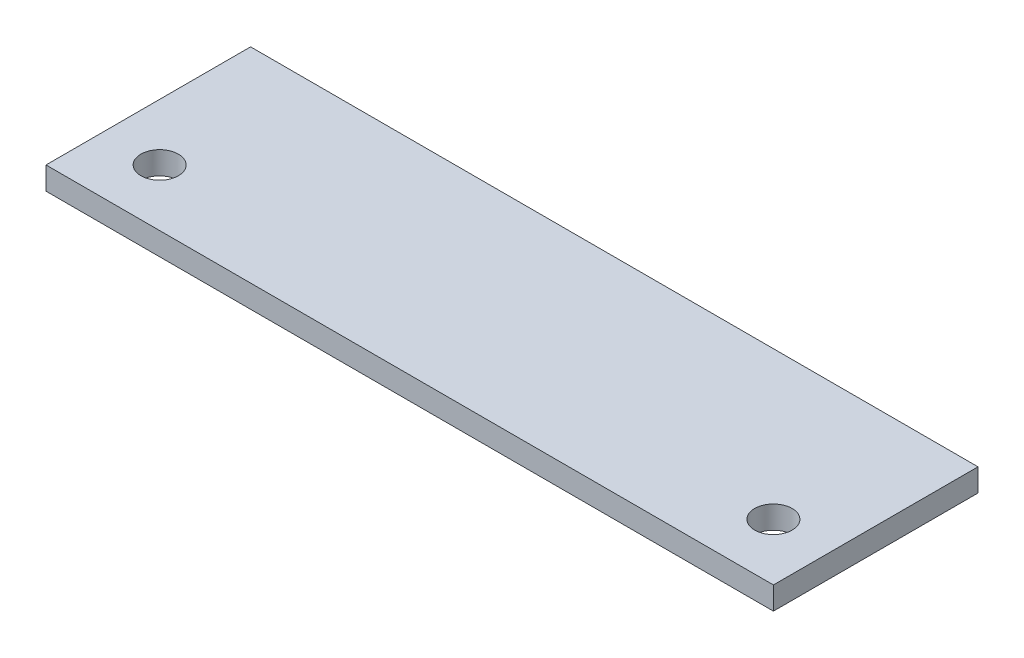
ISO-10303-21;
HEADER;
FILE_DESCRIPTION(('STEP AP214'),'2;1');
FILE_NAME('part.step','',(''),(''),'','','');
FILE_SCHEMA(('AUTOMOTIVE_DESIGN { 1 0 10303 214 1 1 1 1 }'));
ENDSEC;
DATA;
#1=APPLICATION_CONTEXT('core data for automotive mechanical design processes');
#2=APPLICATION_PROTOCOL_DEFINITION('international standard','automotive_design',2000,#1);
#3=PRODUCT_CONTEXT('',#1,'mechanical');
#4=PRODUCT('Part','Part','',(#3));
#5=PRODUCT_RELATED_PRODUCT_CATEGORY('part','',(#4));
#6=PRODUCT_DEFINITION_FORMATION('','',#4);
#7=PRODUCT_DEFINITION_CONTEXT('part definition',#1,'design');
#8=PRODUCT_DEFINITION('design','',#6,#7);
#9=PRODUCT_DEFINITION_SHAPE('','',#8);
#10=(LENGTH_UNIT() NAMED_UNIT(*) SI_UNIT(.MILLI.,.METRE.));
#11=(NAMED_UNIT(*) PLANE_ANGLE_UNIT() SI_UNIT($,.RADIAN.));
#12=(NAMED_UNIT(*) SI_UNIT($,.STERADIAN.) SOLID_ANGLE_UNIT());
#13=UNCERTAINTY_MEASURE_WITH_UNIT(LENGTH_MEASURE(1.E-05),#10,'distance_accuracy_value','');
#14=(GEOMETRIC_REPRESENTATION_CONTEXT(3) GLOBAL_UNCERTAINTY_ASSIGNED_CONTEXT((#13)) GLOBAL_UNIT_ASSIGNED_CONTEXT((#10,
#11,#12)) REPRESENTATION_CONTEXT('',''));
#15=CARTESIAN_POINT('',(0.,0.,0.));
#16=DIRECTION('',(0.,0.,1.));
#17=DIRECTION('',(1.,0.,0.));
#18=AXIS2_PLACEMENT_3D('',#15,#16,#17);
#19=CARTESIAN_POINT('',(0.,12.7,0.));
#20=DIRECTION('',(1.,0.,0.));
#21=DIRECTION('',(0.,0.,-1.));
#22=AXIS2_PLACEMENT_3D('',#19,#20,#21);
#23=PLANE('',#22);
#24=DIRECTION('',(0.,0.,1.));
#25=VECTOR('',#24,1.);
#26=CARTESIAN_POINT('',(0.,0.,0.));
#27=LINE('',#26,#25);
#28=CARTESIAN_POINT('',(0.,0.,-114.3));
#29=VERTEX_POINT('',#28);
#30=CARTESIAN_POINT('',(0.,0.,0.));
#31=VERTEX_POINT('',#30);
#32=EDGE_CURVE('E96',#29,#31,#27,.T.);
#33=ORIENTED_EDGE('',*,*,#32,.T.);
#34=DIRECTION('',(0.,-1.,0.));
#35=VECTOR('',#34,1.);
#36=CARTESIAN_POINT('',(0.,12.7,0.));
#37=LINE('',#36,#35);
#38=CARTESIAN_POINT('',(0.,12.7,0.));
#39=VERTEX_POINT('',#38);
#40=EDGE_CURVE('E11',#39,#31,#37,.T.);
#41=ORIENTED_EDGE('',*,*,#40,.F.);
#42=DIRECTION('',(0.,0.,1.));
#43=VECTOR('',#42,1.);
#44=CARTESIAN_POINT('',(0.,12.7,0.));
#45=LINE('',#44,#43);
#46=CARTESIAN_POINT('',(0.,12.7,-114.3));
#47=VERTEX_POINT('',#46);
#48=EDGE_CURVE('E84',#47,#39,#45,.T.);
#49=ORIENTED_EDGE('',*,*,#48,.F.);
#50=DIRECTION('',(0.,-1.,0.));
#51=VECTOR('',#50,1.);
#52=CARTESIAN_POINT('',(0.,12.7,-114.3));
#53=LINE('',#52,#51);
#54=EDGE_CURVE('E92',#47,#29,#53,.T.);
#55=ORIENTED_EDGE('',*,*,#54,.T.);
#56=EDGE_LOOP('',(#33,#41,#49,#55));
#57=FACE_BOUND('',#56,.T.);
#58=ADVANCED_FACE('F33',(#57),#23,.F.);
#59=CARTESIAN_POINT('',(0.,12.7,0.));
#60=DIRECTION('',(0.,0.,-1.));
#61=DIRECTION('',(-1.,0.,0.));
#62=AXIS2_PLACEMENT_3D('',#59,#60,#61);
#63=PLANE('',#62);
#64=DIRECTION('',(1.,0.,0.));
#65=VECTOR('',#64,1.);
#66=CARTESIAN_POINT('',(0.,0.,0.));
#67=LINE('',#66,#65);
#68=CARTESIAN_POINT('',(406.4,0.,0.));
#69=VERTEX_POINT('',#68);
#70=EDGE_CURVE('E88',#31,#69,#67,.T.);
#71=ORIENTED_EDGE('',*,*,#70,.T.);
#72=DIRECTION('',(0.,-1.,0.));
#73=VECTOR('',#72,1.);
#74=CARTESIAN_POINT('',(406.4,12.7,0.));
#75=LINE('',#74,#73);
#76=CARTESIAN_POINT('',(406.4,12.7,0.));
#77=VERTEX_POINT('',#76);
#78=EDGE_CURVE('E41',#77,#69,#75,.T.);
#79=ORIENTED_EDGE('',*,*,#78,.F.);
#80=DIRECTION('',(1.,0.,0.));
#81=VECTOR('',#80,1.);
#82=CARTESIAN_POINT('',(0.,12.7,0.));
#83=LINE('',#82,#81);
#84=EDGE_CURVE('E79',#39,#77,#83,.T.);
#85=ORIENTED_EDGE('',*,*,#84,.F.);
#86=ORIENTED_EDGE('',*,*,#40,.T.);
#87=EDGE_LOOP('',(#71,#79,#85,#86));
#88=FACE_BOUND('',#87,.T.);
#89=ADVANCED_FACE('F87',(#88),#63,.F.);
#90=CARTESIAN_POINT('',(406.4,12.7,0.));
#91=DIRECTION('',(-1.,0.,0.));
#92=DIRECTION('',(0.,0.,1.));
#93=AXIS2_PLACEMENT_3D('',#90,#91,#92);
#94=PLANE('',#93);
#95=DIRECTION('',(0.,0.,-1.));
#96=VECTOR('',#95,1.);
#97=CARTESIAN_POINT('',(406.4,0.,0.));
#98=LINE('',#97,#96);
#99=CARTESIAN_POINT('',(406.4,0.,-114.3));
#100=VERTEX_POINT('',#99);
#101=EDGE_CURVE('E66',#69,#100,#98,.T.);
#102=ORIENTED_EDGE('',*,*,#101,.T.);
#103=DIRECTION('',(0.,-1.,0.));
#104=VECTOR('',#103,1.);
#105=CARTESIAN_POINT('',(406.4,12.7,-114.3));
#106=LINE('',#105,#104);
#107=CARTESIAN_POINT('',(406.4,12.7,-114.3));
#108=VERTEX_POINT('',#107);
#109=EDGE_CURVE('E89',#108,#100,#106,.T.);
#110=ORIENTED_EDGE('',*,*,#109,.F.);
#111=DIRECTION('',(0.,0.,-1.));
#112=VECTOR('',#111,1.);
#113=CARTESIAN_POINT('',(406.4,12.7,0.));
#114=LINE('',#113,#112);
#115=EDGE_CURVE('E82',#77,#108,#114,.T.);
#116=ORIENTED_EDGE('',*,*,#115,.F.);
#117=ORIENTED_EDGE('',*,*,#78,.T.);
#118=EDGE_LOOP('',(#102,#110,#116,#117));
#119=FACE_BOUND('',#118,.T.);
#120=ADVANCED_FACE('F90',(#119),#94,.F.);
#121=CARTESIAN_POINT('',(0.,12.7,-114.3));
#122=DIRECTION('',(0.,0.,1.));
#123=DIRECTION('',(1.,0.,0.));
#124=AXIS2_PLACEMENT_3D('',#121,#122,#123);
#125=PLANE('',#124);
#126=DIRECTION('',(-1.,0.,0.));
#127=VECTOR('',#126,1.);
#128=CARTESIAN_POINT('',(0.,0.,-114.3));
#129=LINE('',#128,#127);
#130=EDGE_CURVE('E72',#100,#29,#129,.T.);
#131=ORIENTED_EDGE('',*,*,#130,.T.);
#132=ORIENTED_EDGE('',*,*,#54,.F.);
#133=DIRECTION('',(-1.,0.,0.));
#134=VECTOR('',#133,1.);
#135=CARTESIAN_POINT('',(0.,12.7,-114.3));
#136=LINE('',#135,#134);
#137=EDGE_CURVE('E49',#108,#47,#136,.T.);
#138=ORIENTED_EDGE('',*,*,#137,.F.);
#139=ORIENTED_EDGE('',*,*,#109,.T.);
#140=EDGE_LOOP('',(#131,#132,#138,#139));
#141=FACE_BOUND('',#140,.T.);
#142=ADVANCED_FACE('F104',(#141),#125,.F.);
#143=CARTESIAN_POINT('',(0.,12.7,-114.3));
#144=DIRECTION('',(0.,-1.,0.));
#145=DIRECTION('',(0.,0.,-1.));
#146=AXIS2_PLACEMENT_3D('',#143,#144,#145);
#147=PLANE('',#146);
#148=CARTESIAN_POINT('',(374.65,12.7,-31.75));
#149=DIRECTION('',(0.,1.,0.));
#150=DIRECTION('',(0.,0.,-1.));
#151=AXIS2_PLACEMENT_3D('',#148,#149,#150);
#152=CIRCLE('',#151,10.4775);
#153=CARTESIAN_POINT('',(374.65,12.7,-42.2275));
#154=VERTEX_POINT('',#153);
#155=EDGE_CURVE('E113',#154,#154,#152,.T.);
#156=ORIENTED_EDGE('',*,*,#155,.F.);
#157=EDGE_LOOP('',(#156));
#158=FACE_BOUND('',#157,.T.);
#159=CARTESIAN_POINT('',(31.75,12.7,-31.75));
#160=DIRECTION('',(0.,1.,0.));
#161=DIRECTION('',(0.,0.,1.));
#162=AXIS2_PLACEMENT_3D('',#159,#160,#161);
#163=CIRCLE('',#162,10.4775);
#164=CARTESIAN_POINT('',(31.75,12.7,-21.2725));
#165=VERTEX_POINT('',#164);
#166=EDGE_CURVE('E99',#165,#165,#163,.T.);
#167=ORIENTED_EDGE('',*,*,#166,.F.);
#168=EDGE_LOOP('',(#167));
#169=FACE_BOUND('',#168,.T.);
#170=ORIENTED_EDGE('',*,*,#48,.T.);
#171=ORIENTED_EDGE('',*,*,#84,.T.);
#172=ORIENTED_EDGE('',*,*,#115,.T.);
#173=ORIENTED_EDGE('',*,*,#137,.T.);
#174=EDGE_LOOP('',(#170,#171,#172,#173));
#175=FACE_BOUND('',#174,.T.);
#176=ADVANCED_FACE('F80',(#158,#169,#175),#147,.F.);
#177=CARTESIAN_POINT('',(0.,0.,-114.3));
#178=DIRECTION('',(0.,-1.,0.));
#179=DIRECTION('',(0.,0.,-1.));
#180=AXIS2_PLACEMENT_3D('',#177,#178,#179);
#181=PLANE('',#180);
#182=CARTESIAN_POINT('',(374.65,0.,-31.75));
#183=DIRECTION('',(0.,-1.,0.));
#184=DIRECTION('',(0.,0.,-1.));
#185=AXIS2_PLACEMENT_3D('',#182,#183,#184);
#186=CIRCLE('',#185,10.4775);
#187=CARTESIAN_POINT('',(374.65,0.,-42.2275));
#188=VERTEX_POINT('',#187);
#189=EDGE_CURVE('E116',#188,#188,#186,.F.);
#190=ORIENTED_EDGE('',*,*,#189,.T.);
#191=EDGE_LOOP('',(#190));
#192=FACE_BOUND('',#191,.T.);
#193=CARTESIAN_POINT('',(31.75,0.,-31.75));
#194=DIRECTION('',(0.,-1.,0.));
#195=DIRECTION('',(0.,0.,-1.));
#196=AXIS2_PLACEMENT_3D('',#193,#194,#195);
#197=CIRCLE('',#196,10.4775);
#198=CARTESIAN_POINT('',(31.75,0.,-42.2275));
#199=VERTEX_POINT('',#198);
#200=EDGE_CURVE('E110',#199,#199,#197,.F.);
#201=ORIENTED_EDGE('',*,*,#200,.T.);
#202=EDGE_LOOP('',(#201));
#203=FACE_BOUND('',#202,.T.);
#204=ORIENTED_EDGE('',*,*,#32,.F.);
#205=ORIENTED_EDGE('',*,*,#130,.F.);
#206=ORIENTED_EDGE('',*,*,#101,.F.);
#207=ORIENTED_EDGE('',*,*,#70,.F.);
#208=EDGE_LOOP('',(#204,#205,#206,#207));
#209=FACE_BOUND('',#208,.T.);
#210=ADVANCED_FACE('F107',(#192,#203,#209),#181,.T.);
#211=CARTESIAN_POINT('',(31.75,-0.000999999999999265,-31.75));
#212=DIRECTION('',(0.,1.,0.));
#213=DIRECTION('',(0.,0.,1.));
#214=AXIS2_PLACEMENT_3D('',#211,#212,#213);
#215=CYLINDRICAL_SURFACE('',#214,10.4775);
#216=ORIENTED_EDGE('',*,*,#200,.F.);
#217=EDGE_LOOP('',(#216));
#218=FACE_BOUND('',#217,.T.);
#219=ORIENTED_EDGE('',*,*,#166,.T.);
#220=EDGE_LOOP('',(#219));
#221=FACE_BOUND('',#220,.T.);
#222=ADVANCED_FACE('F129',(#218,#221),#215,.F.);
#223=CARTESIAN_POINT('',(374.65,-0.000999999999999265,-31.75));
#224=DIRECTION('',(0.,1.,0.));
#225=DIRECTION('',(0.,0.,1.));
#226=AXIS2_PLACEMENT_3D('',#223,#224,#225);
#227=CYLINDRICAL_SURFACE('',#226,10.4775);
#228=ORIENTED_EDGE('',*,*,#189,.F.);
#229=EDGE_LOOP('',(#228));
#230=FACE_BOUND('',#229,.T.);
#231=ORIENTED_EDGE('',*,*,#155,.T.);
#232=EDGE_LOOP('',(#231));
#233=FACE_BOUND('',#232,.T.);
#234=ADVANCED_FACE('F122',(#230,#233),#227,.F.);
#235=CLOSED_SHELL('',(#58,#89,#120,#142,#176,#210,#222,#234));
#236=MANIFOLD_SOLID_BREP('B2',#235);
#237=ADVANCED_BREP_SHAPE_REPRESENTATION('',(#18,#236),#14);
#238=SHAPE_DEFINITION_REPRESENTATION(#9,#237);
ENDSEC;
END-ISO-10303-21;
